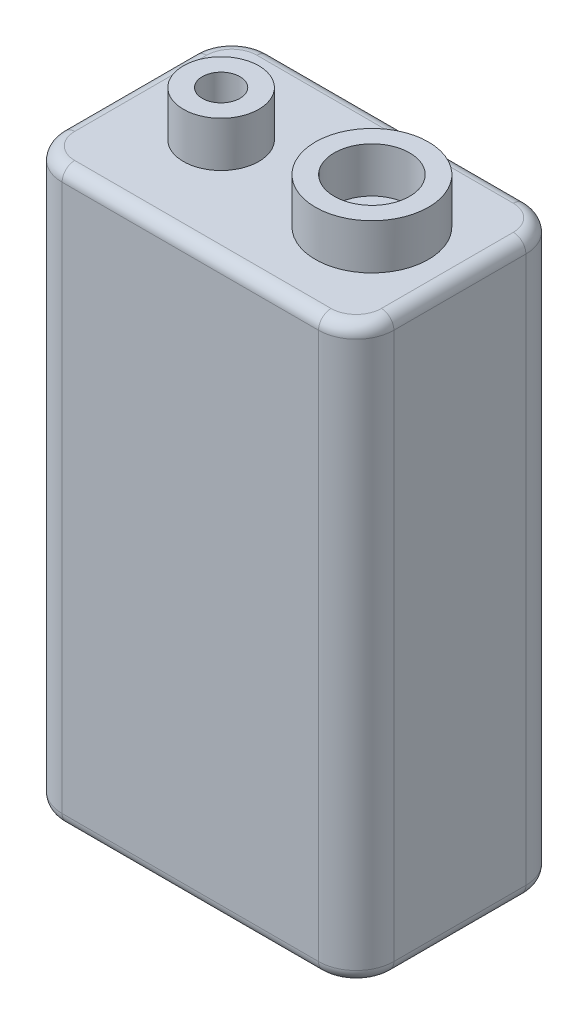
ISO-10303-21;
HEADER;
FILE_DESCRIPTION(('STEP AP214'),'2;1');
FILE_NAME('part.step','',(''),(''),'','','');
FILE_SCHEMA(('AUTOMOTIVE_DESIGN { 1 0 10303 214 1 1 1 1 }'));
ENDSEC;
DATA;
#1=APPLICATION_CONTEXT('core data for automotive mechanical design processes');
#2=APPLICATION_PROTOCOL_DEFINITION('international standard','automotive_design',2000,#1);
#3=PRODUCT_CONTEXT('',#1,'mechanical');
#4=PRODUCT('Part','Part','',(#3));
#5=PRODUCT_RELATED_PRODUCT_CATEGORY('part','',(#4));
#6=PRODUCT_DEFINITION_FORMATION('','',#4);
#7=PRODUCT_DEFINITION_CONTEXT('part definition',#1,'design');
#8=PRODUCT_DEFINITION('design','',#6,#7);
#9=PRODUCT_DEFINITION_SHAPE('','',#8);
#10=(LENGTH_UNIT() NAMED_UNIT(*) SI_UNIT(.MILLI.,.METRE.));
#11=(NAMED_UNIT(*) PLANE_ANGLE_UNIT() SI_UNIT($,.RADIAN.));
#12=(NAMED_UNIT(*) SI_UNIT($,.STERADIAN.) SOLID_ANGLE_UNIT());
#13=UNCERTAINTY_MEASURE_WITH_UNIT(LENGTH_MEASURE(1.E-05),#10,'distance_accuracy_value','');
#14=(GEOMETRIC_REPRESENTATION_CONTEXT(3) GLOBAL_UNCERTAINTY_ASSIGNED_CONTEXT((#13)) GLOBAL_UNIT_ASSIGNED_CONTEXT((#10,
#11,#12)) REPRESENTATION_CONTEXT('',''));
#15=CARTESIAN_POINT('',(0.,0.,0.));
#16=DIRECTION('',(0.,0.,1.));
#17=DIRECTION('',(1.,0.,0.));
#18=AXIS2_PLACEMENT_3D('',#15,#16,#17);
#19=CARTESIAN_POINT('',(0.,45.5,16.5));
#20=DIRECTION('',(0.,-1.,0.));
#21=DIRECTION('',(0.,0.,-1.));
#22=AXIS2_PLACEMENT_3D('',#19,#20,#21);
#23=PLANE('',#22);
#24=DIRECTION('',(-1.,0.,0.));
#25=VECTOR('',#24,1.);
#26=CARTESIAN_POINT('',(0.,45.5,15.5));
#27=LINE('',#26,#25);
#28=CARTESIAN_POINT('',(3.,45.5,15.5));
#29=VERTEX_POINT('',#28);
#30=CARTESIAN_POINT('',(23.4,45.5,15.5));
#31=VERTEX_POINT('',#30);
#32=EDGE_CURVE('E154',#29,#31,#27,.F.);
#33=ORIENTED_EDGE('',*,*,#32,.T.);
#34=CARTESIAN_POINT('',(23.4,45.5,13.5));
#35=DIRECTION('',(0.,-1.,0.));
#36=DIRECTION('',(0.,0.,-1.));
#37=AXIS2_PLACEMENT_3D('',#34,#35,#36);
#38=CIRCLE('',#37,2.);
#39=CARTESIAN_POINT('',(25.4,45.5,13.5));
#40=VERTEX_POINT('',#39);
#41=EDGE_CURVE('E191',#31,#40,#38,.F.);
#42=ORIENTED_EDGE('',*,*,#41,.T.);
#43=DIRECTION('',(0.,0.,-1.));
#44=VECTOR('',#43,1.);
#45=CARTESIAN_POINT('',(25.4,45.5,16.5));
#46=LINE('',#45,#44);
#47=CARTESIAN_POINT('',(25.4,45.5,3.));
#48=VERTEX_POINT('',#47);
#49=EDGE_CURVE('E189',#40,#48,#46,.T.);
#50=ORIENTED_EDGE('',*,*,#49,.T.);
#51=CARTESIAN_POINT('',(23.4,45.5,3.));
#52=DIRECTION('',(0.,-1.,0.));
#53=DIRECTION('',(0.,0.,-1.));
#54=AXIS2_PLACEMENT_3D('',#51,#52,#53);
#55=CIRCLE('',#54,2.);
#56=CARTESIAN_POINT('',(23.4,45.5,1.));
#57=VERTEX_POINT('',#56);
#58=EDGE_CURVE('E187',#48,#57,#55,.F.);
#59=ORIENTED_EDGE('',*,*,#58,.T.);
#60=DIRECTION('',(-1.,0.,0.));
#61=VECTOR('',#60,1.);
#62=CARTESIAN_POINT('',(3.,45.5,1.));
#63=LINE('',#62,#61);
#64=CARTESIAN_POINT('',(3.,45.5,0.999999999999999));
#65=VERTEX_POINT('',#64);
#66=EDGE_CURVE('E185',#57,#65,#63,.T.);
#67=ORIENTED_EDGE('',*,*,#66,.T.);
#68=CARTESIAN_POINT('',(3.,45.5,3.));
#69=DIRECTION('',(0.,-1.,0.));
#70=DIRECTION('',(0.,0.,-1.));
#71=AXIS2_PLACEMENT_3D('',#68,#69,#70);
#72=CIRCLE('',#71,2.);
#73=CARTESIAN_POINT('',(1.,45.5,3.));
#74=VERTEX_POINT('',#73);
#75=EDGE_CURVE('E183',#65,#74,#72,.F.);
#76=ORIENTED_EDGE('',*,*,#75,.T.);
#77=DIRECTION('',(0.,0.,-1.));
#78=VECTOR('',#77,1.);
#79=CARTESIAN_POINT('',(1.,45.5,16.5));
#80=LINE('',#79,#78);
#81=CARTESIAN_POINT('',(1.,45.5,13.5));
#82=VERTEX_POINT('',#81);
#83=EDGE_CURVE('E157',#74,#82,#80,.F.);
#84=ORIENTED_EDGE('',*,*,#83,.T.);
#85=CARTESIAN_POINT('',(3.,45.5,13.5));
#86=DIRECTION('',(0.,-1.,0.));
#87=DIRECTION('',(0.,0.,-1.));
#88=AXIS2_PLACEMENT_3D('',#85,#86,#87);
#89=CIRCLE('',#88,2.);
#90=EDGE_CURVE('E149',#82,#29,#89,.F.);
#91=ORIENTED_EDGE('',*,*,#90,.T.);
#92=EDGE_LOOP('',(#33,#42,#50,#59,#67,#76,#84,#91));
#93=FACE_BOUND('',#92,.T.);
#94=CARTESIAN_POINT('',(7.4,45.5,8.25));
#95=DIRECTION('',(0.,-1.,0.));
#96=DIRECTION('',(0.,0.,-1.));
#97=AXIS2_PLACEMENT_3D('',#94,#95,#96);
#98=CIRCLE('',#97,3.);
#99=CARTESIAN_POINT('',(7.4,45.5,5.25));
#100=VERTEX_POINT('',#99);
#101=EDGE_CURVE('E178',#100,#100,#98,.F.);
#102=ORIENTED_EDGE('',*,*,#101,.F.);
#103=EDGE_LOOP('',(#102));
#104=FACE_BOUND('',#103,.T.);
#105=CARTESIAN_POINT('',(19.4,45.5,8.25));
#106=DIRECTION('',(0.,-1.,0.));
#107=DIRECTION('',(0.,0.,-1.));
#108=AXIS2_PLACEMENT_3D('',#105,#106,#107);
#109=CIRCLE('',#108,4.5);
#110=CARTESIAN_POINT('',(19.4,45.5,3.75));
#111=VERTEX_POINT('',#110);
#112=EDGE_CURVE('E175',#111,#111,#109,.F.);
#113=ORIENTED_EDGE('',*,*,#112,.F.);
#114=EDGE_LOOP('',(#113));
#115=FACE_BOUND('',#114,.T.);
#116=ADVANCED_FACE('F36',(#93,#104,#115),#23,.F.);
#117=CARTESIAN_POINT('',(0.,0.,16.5));
#118=DIRECTION('',(1.,0.,0.));
#119=DIRECTION('',(0.,0.,-1.));
#120=AXIS2_PLACEMENT_3D('',#117,#118,#119);
#121=PLANE('',#120);
#122=DIRECTION('',(0.,-1.,0.));
#123=VECTOR('',#122,1.);
#124=CARTESIAN_POINT('',(0.,0.,13.5));
#125=LINE('',#124,#123);
#126=CARTESIAN_POINT('',(0.,1.,13.5));
#127=VERTEX_POINT('',#126);
#128=CARTESIAN_POINT('',(0.,44.5,13.5));
#129=VERTEX_POINT('',#128);
#130=EDGE_CURVE('E304',#127,#129,#125,.F.);
#131=ORIENTED_EDGE('',*,*,#130,.T.);
#132=DIRECTION('',(0.,0.,-1.));
#133=VECTOR('',#132,1.);
#134=CARTESIAN_POINT('',(0.,44.5,16.5));
#135=LINE('',#134,#133);
#136=CARTESIAN_POINT('',(0.,44.5,3.));
#137=VERTEX_POINT('',#136);
#138=EDGE_CURVE('E216',#129,#137,#135,.T.);
#139=ORIENTED_EDGE('',*,*,#138,.T.);
#140=DIRECTION('',(0.,-1.,0.));
#141=VECTOR('',#140,1.);
#142=CARTESIAN_POINT('',(0.,0.,3.));
#143=LINE('',#142,#141);
#144=CARTESIAN_POINT('',(0.,1.,3.));
#145=VERTEX_POINT('',#144);
#146=EDGE_CURVE('E299',#137,#145,#143,.T.);
#147=ORIENTED_EDGE('',*,*,#146,.T.);
#148=DIRECTION('',(0.,0.,-1.));
#149=VECTOR('',#148,1.);
#150=CARTESIAN_POINT('',(0.,1.,16.5));
#151=LINE('',#150,#149);
#152=EDGE_CURVE('E214',#145,#127,#151,.F.);
#153=ORIENTED_EDGE('',*,*,#152,.T.);
#154=EDGE_LOOP('',(#131,#139,#147,#153));
#155=FACE_BOUND('',#154,.T.);
#156=ADVANCED_FACE('F322',(#155),#121,.F.);
#157=CARTESIAN_POINT('',(0.,0.,16.5));
#158=DIRECTION('',(0.,1.,0.));
#159=DIRECTION('',(0.,0.,1.));
#160=AXIS2_PLACEMENT_3D('',#157,#158,#159);
#161=PLANE('',#160);
#162=DIRECTION('',(1.,0.,0.));
#163=VECTOR('',#162,1.);
#164=CARTESIAN_POINT('',(0.,0.,15.5));
#165=LINE('',#164,#163);
#166=CARTESIAN_POINT('',(23.4,0.,15.5));
#167=VERTEX_POINT('',#166);
#168=CARTESIAN_POINT('',(3.,0.,15.5));
#169=VERTEX_POINT('',#168);
#170=EDGE_CURVE('E53',#167,#169,#165,.F.);
#171=ORIENTED_EDGE('',*,*,#170,.T.);
#172=CARTESIAN_POINT('',(3.,0.,13.5));
#173=DIRECTION('',(0.,1.,0.));
#174=DIRECTION('',(0.,0.,1.));
#175=AXIS2_PLACEMENT_3D('',#172,#173,#174);
#176=CIRCLE('',#175,2.);
#177=CARTESIAN_POINT('',(1.,0.,13.5));
#178=VERTEX_POINT('',#177);
#179=EDGE_CURVE('E234',#169,#178,#176,.F.);
#180=ORIENTED_EDGE('',*,*,#179,.T.);
#181=DIRECTION('',(0.,0.,-1.));
#182=VECTOR('',#181,1.);
#183=CARTESIAN_POINT('',(1.,0.,16.5));
#184=LINE('',#183,#182);
#185=CARTESIAN_POINT('',(1.,0.,3.));
#186=VERTEX_POINT('',#185);
#187=EDGE_CURVE('E222',#178,#186,#184,.T.);
#188=ORIENTED_EDGE('',*,*,#187,.T.);
#189=CARTESIAN_POINT('',(3.,0.,3.));
#190=DIRECTION('',(0.,1.,0.));
#191=DIRECTION('',(0.,0.,1.));
#192=AXIS2_PLACEMENT_3D('',#189,#190,#191);
#193=CIRCLE('',#192,2.);
#194=CARTESIAN_POINT('',(3.,0.,0.999999999999999));
#195=VERTEX_POINT('',#194);
#196=EDGE_CURVE('E224',#186,#195,#193,.F.);
#197=ORIENTED_EDGE('',*,*,#196,.T.);
#198=DIRECTION('',(1.,0.,0.));
#199=VECTOR('',#198,1.);
#200=CARTESIAN_POINT('',(23.4,0.,1.));
#201=LINE('',#200,#199);
#202=CARTESIAN_POINT('',(23.4,0.,1.));
#203=VERTEX_POINT('',#202);
#204=EDGE_CURVE('E226',#195,#203,#201,.T.);
#205=ORIENTED_EDGE('',*,*,#204,.T.);
#206=CARTESIAN_POINT('',(23.4,0.,3.));
#207=DIRECTION('',(0.,1.,0.));
#208=DIRECTION('',(0.,0.,1.));
#209=AXIS2_PLACEMENT_3D('',#206,#207,#208);
#210=CIRCLE('',#209,2.);
#211=CARTESIAN_POINT('',(25.4,0.,3.));
#212=VERTEX_POINT('',#211);
#213=EDGE_CURVE('E228',#203,#212,#210,.F.);
#214=ORIENTED_EDGE('',*,*,#213,.T.);
#215=DIRECTION('',(0.,0.,-1.));
#216=VECTOR('',#215,1.);
#217=CARTESIAN_POINT('',(25.4,0.,16.5));
#218=LINE('',#217,#216);
#219=CARTESIAN_POINT('',(25.4,0.,13.5));
#220=VERTEX_POINT('',#219);
#221=EDGE_CURVE('E230',#212,#220,#218,.F.);
#222=ORIENTED_EDGE('',*,*,#221,.T.);
#223=CARTESIAN_POINT('',(23.4,0.,13.5));
#224=DIRECTION('',(0.,1.,0.));
#225=DIRECTION('',(0.,0.,1.));
#226=AXIS2_PLACEMENT_3D('',#223,#224,#225);
#227=CIRCLE('',#226,2.);
#228=EDGE_CURVE('E58',#220,#167,#227,.F.);
#229=ORIENTED_EDGE('',*,*,#228,.T.);
#230=EDGE_LOOP('',(#171,#180,#188,#197,#205,#214,#222,#229));
#231=FACE_BOUND('',#230,.T.);
#232=ADVANCED_FACE('F368',(#231),#161,.F.);
#233=CARTESIAN_POINT('',(26.4,0.,16.5));
#234=DIRECTION('',(-1.,0.,0.));
#235=DIRECTION('',(0.,0.,1.));
#236=AXIS2_PLACEMENT_3D('',#233,#234,#235);
#237=PLANE('',#236);
#238=DIRECTION('',(0.,1.,0.));
#239=VECTOR('',#238,1.);
#240=CARTESIAN_POINT('',(26.4,45.5,3.));
#241=LINE('',#240,#239);
#242=CARTESIAN_POINT('',(26.4,1.,3.));
#243=VERTEX_POINT('',#242);
#244=CARTESIAN_POINT('',(26.4,44.5,3.));
#245=VERTEX_POINT('',#244);
#246=EDGE_CURVE('E292',#243,#245,#241,.T.);
#247=ORIENTED_EDGE('',*,*,#246,.T.);
#248=DIRECTION('',(0.,0.,-1.));
#249=VECTOR('',#248,1.);
#250=CARTESIAN_POINT('',(26.4,44.5,16.5));
#251=LINE('',#250,#249);
#252=CARTESIAN_POINT('',(26.4,44.5,13.5));
#253=VERTEX_POINT('',#252);
#254=EDGE_CURVE('E200',#245,#253,#251,.F.);
#255=ORIENTED_EDGE('',*,*,#254,.T.);
#256=DIRECTION('',(0.,1.,0.));
#257=VECTOR('',#256,1.);
#258=CARTESIAN_POINT('',(26.4,0.,13.5));
#259=LINE('',#258,#257);
#260=CARTESIAN_POINT('',(26.4,1.,13.5));
#261=VERTEX_POINT('',#260);
#262=EDGE_CURVE('E313',#253,#261,#259,.F.);
#263=ORIENTED_EDGE('',*,*,#262,.T.);
#264=DIRECTION('',(0.,0.,-1.));
#265=VECTOR('',#264,1.);
#266=CARTESIAN_POINT('',(26.4,1.,16.5));
#267=LINE('',#266,#265);
#268=EDGE_CURVE('E198',#261,#243,#267,.T.);
#269=ORIENTED_EDGE('',*,*,#268,.T.);
#270=EDGE_LOOP('',(#247,#255,#263,#269));
#271=FACE_BOUND('',#270,.T.);
#272=ADVANCED_FACE('F359',(#271),#237,.F.);
#273=CARTESIAN_POINT('',(0.,0.,16.5));
#274=DIRECTION('',(0.,0.,-1.));
#275=DIRECTION('',(-1.,0.,0.));
#276=AXIS2_PLACEMENT_3D('',#273,#274,#275);
#277=PLANE('',#276);
#278=DIRECTION('',(0.,-1.,0.));
#279=VECTOR('',#278,1.);
#280=CARTESIAN_POINT('',(3.,0.,16.5));
#281=LINE('',#280,#279);
#282=CARTESIAN_POINT('',(3.,44.5,16.5));
#283=VERTEX_POINT('',#282);
#284=CARTESIAN_POINT('',(3.,1.,16.5));
#285=VERTEX_POINT('',#284);
#286=EDGE_CURVE('E310',#283,#285,#281,.T.);
#287=ORIENTED_EDGE('',*,*,#286,.T.);
#288=DIRECTION('',(1.,0.,0.));
#289=VECTOR('',#288,1.);
#290=CARTESIAN_POINT('',(0.,1.,16.5));
#291=LINE('',#290,#289);
#292=CARTESIAN_POINT('',(23.4,1.,16.5));
#293=VERTEX_POINT('',#292);
#294=EDGE_CURVE('E11',#285,#293,#291,.T.);
#295=ORIENTED_EDGE('',*,*,#294,.T.);
#296=DIRECTION('',(0.,1.,0.));
#297=VECTOR('',#296,1.);
#298=CARTESIAN_POINT('',(23.4,0.,16.5));
#299=LINE('',#298,#297);
#300=CARTESIAN_POINT('',(23.4,44.5,16.5));
#301=VERTEX_POINT('',#300);
#302=EDGE_CURVE('E301',#293,#301,#299,.T.);
#303=ORIENTED_EDGE('',*,*,#302,.T.);
#304=DIRECTION('',(-1.,0.,0.));
#305=VECTOR('',#304,1.);
#306=CARTESIAN_POINT('',(0.,44.5,16.5));
#307=LINE('',#306,#305);
#308=EDGE_CURVE('E45',#301,#283,#307,.T.);
#309=ORIENTED_EDGE('',*,*,#308,.T.);
#310=EDGE_LOOP('',(#287,#295,#303,#309));
#311=FACE_BOUND('',#310,.T.);
#312=ADVANCED_FACE('F356',(#311),#277,.F.);
#313=CARTESIAN_POINT('',(0.,0.,0.));
#314=DIRECTION('',(0.,0.,-1.));
#315=DIRECTION('',(-1.,0.,0.));
#316=AXIS2_PLACEMENT_3D('',#313,#314,#315);
#317=PLANE('',#316);
#318=DIRECTION('',(0.,-1.,0.));
#319=VECTOR('',#318,1.);
#320=CARTESIAN_POINT('',(3.,45.5,0.));
#321=LINE('',#320,#319);
#322=CARTESIAN_POINT('',(3.,1.,0.));
#323=VERTEX_POINT('',#322);
#324=CARTESIAN_POINT('',(3.,44.5,0.));
#325=VERTEX_POINT('',#324);
#326=EDGE_CURVE('E298',#323,#325,#321,.F.);
#327=ORIENTED_EDGE('',*,*,#326,.T.);
#328=DIRECTION('',(-1.,0.,0.));
#329=VECTOR('',#328,1.);
#330=CARTESIAN_POINT('',(23.4,44.5,0.));
#331=LINE('',#330,#329);
#332=CARTESIAN_POINT('',(23.4,44.5,0.));
#333=VERTEX_POINT('',#332);
#334=EDGE_CURVE('E208',#325,#333,#331,.F.);
#335=ORIENTED_EDGE('',*,*,#334,.T.);
#336=DIRECTION('',(0.,1.,0.));
#337=VECTOR('',#336,1.);
#338=CARTESIAN_POINT('',(23.4,0.,0.));
#339=LINE('',#338,#337);
#340=CARTESIAN_POINT('',(23.4,1.,0.));
#341=VERTEX_POINT('',#340);
#342=EDGE_CURVE('E289',#333,#341,#339,.F.);
#343=ORIENTED_EDGE('',*,*,#342,.T.);
#344=DIRECTION('',(1.,0.,0.));
#345=VECTOR('',#344,1.);
#346=CARTESIAN_POINT('',(3.,1.,0.));
#347=LINE('',#346,#345);
#348=EDGE_CURVE('E206',#341,#323,#347,.F.);
#349=ORIENTED_EDGE('',*,*,#348,.T.);
#350=EDGE_LOOP('',(#327,#335,#343,#349));
#351=FACE_BOUND('',#350,.T.);
#352=ADVANCED_FACE('F295',(#351),#317,.T.);
#353=CARTESIAN_POINT('',(3.,0.,3.));
#354=DIRECTION('',(0.,1.,0.));
#355=DIRECTION('',(0.,0.,1.));
#356=AXIS2_PLACEMENT_3D('',#353,#354,#355);
#357=CYLINDRICAL_SURFACE('',#356,3.);
#358=ORIENTED_EDGE('',*,*,#146,.F.);
#359=CARTESIAN_POINT('',(3.,44.5,3.));
#360=DIRECTION('',(0.,-1.,0.));
#361=DIRECTION('',(0.,0.,-1.));
#362=AXIS2_PLACEMENT_3D('',#359,#360,#361);
#363=CIRCLE('',#362,3.);
#364=EDGE_CURVE('E212',#137,#325,#363,.T.);
#365=ORIENTED_EDGE('',*,*,#364,.T.);
#366=ORIENTED_EDGE('',*,*,#326,.F.);
#367=CARTESIAN_POINT('',(3.,1.,3.));
#368=DIRECTION('',(0.,1.,0.));
#369=DIRECTION('',(0.,0.,1.));
#370=AXIS2_PLACEMENT_3D('',#367,#368,#369);
#371=CIRCLE('',#370,3.);
#372=EDGE_CURVE('E210',#323,#145,#371,.T.);
#373=ORIENTED_EDGE('',*,*,#372,.T.);
#374=EDGE_LOOP('',(#358,#365,#366,#373));
#375=FACE_BOUND('',#374,.T.);
#376=ADVANCED_FACE('F362',(#375),#357,.T.);
#377=CARTESIAN_POINT('',(3.,0.,13.5));
#378=DIRECTION('',(0.,-1.,0.));
#379=DIRECTION('',(0.,0.,-1.));
#380=AXIS2_PLACEMENT_3D('',#377,#378,#379);
#381=CYLINDRICAL_SURFACE('',#380,3.);
#382=ORIENTED_EDGE('',*,*,#286,.F.);
#383=CARTESIAN_POINT('',(3.,44.5,13.5));
#384=DIRECTION('',(0.,-1.,0.));
#385=DIRECTION('',(0.,0.,-1.));
#386=AXIS2_PLACEMENT_3D('',#383,#384,#385);
#387=CIRCLE('',#386,3.);
#388=EDGE_CURVE('E166',#283,#129,#387,.T.);
#389=ORIENTED_EDGE('',*,*,#388,.T.);
#390=ORIENTED_EDGE('',*,*,#130,.F.);
#391=CARTESIAN_POINT('',(3.,1.,13.5));
#392=DIRECTION('',(0.,1.,0.));
#393=DIRECTION('',(0.,0.,1.));
#394=AXIS2_PLACEMENT_3D('',#391,#392,#393);
#395=CIRCLE('',#394,3.);
#396=EDGE_CURVE('E218',#127,#285,#395,.T.);
#397=ORIENTED_EDGE('',*,*,#396,.T.);
#398=EDGE_LOOP('',(#382,#389,#390,#397));
#399=FACE_BOUND('',#398,.T.);
#400=ADVANCED_FACE('F377',(#399),#381,.T.);
#401=CARTESIAN_POINT('',(23.4,0.,3.));
#402=DIRECTION('',(0.,-1.,0.));
#403=DIRECTION('',(0.,0.,-1.));
#404=AXIS2_PLACEMENT_3D('',#401,#402,#403);
#405=CYLINDRICAL_SURFACE('',#404,3.);
#406=ORIENTED_EDGE('',*,*,#342,.F.);
#407=CARTESIAN_POINT('',(23.4,44.5,3.));
#408=DIRECTION('',(0.,-1.,0.));
#409=DIRECTION('',(0.,0.,-1.));
#410=AXIS2_PLACEMENT_3D('',#407,#408,#409);
#411=CIRCLE('',#410,3.);
#412=EDGE_CURVE('E204',#333,#245,#411,.T.);
#413=ORIENTED_EDGE('',*,*,#412,.T.);
#414=ORIENTED_EDGE('',*,*,#246,.F.);
#415=CARTESIAN_POINT('',(23.4,1.,3.));
#416=DIRECTION('',(0.,1.,0.));
#417=DIRECTION('',(0.,0.,1.));
#418=AXIS2_PLACEMENT_3D('',#415,#416,#417);
#419=CIRCLE('',#418,3.);
#420=EDGE_CURVE('E202',#243,#341,#419,.T.);
#421=ORIENTED_EDGE('',*,*,#420,.T.);
#422=EDGE_LOOP('',(#406,#413,#414,#421));
#423=FACE_BOUND('',#422,.T.);
#424=ADVANCED_FACE('F288',(#423),#405,.T.);
#425=CARTESIAN_POINT('',(23.4,0.,13.5));
#426=DIRECTION('',(0.,1.,0.));
#427=DIRECTION('',(0.,0.,1.));
#428=AXIS2_PLACEMENT_3D('',#425,#426,#427);
#429=CYLINDRICAL_SURFACE('',#428,3.);
#430=ORIENTED_EDGE('',*,*,#262,.F.);
#431=CARTESIAN_POINT('',(23.4,44.5,13.5));
#432=DIRECTION('',(0.,-1.,0.));
#433=DIRECTION('',(0.,0.,-1.));
#434=AXIS2_PLACEMENT_3D('',#431,#432,#433);
#435=CIRCLE('',#434,3.);
#436=EDGE_CURVE('E195',#253,#301,#435,.T.);
#437=ORIENTED_EDGE('',*,*,#436,.T.);
#438=ORIENTED_EDGE('',*,*,#302,.F.);
#439=CARTESIAN_POINT('',(23.4,1.,13.5));
#440=DIRECTION('',(0.,1.,0.));
#441=DIRECTION('',(0.,0.,1.));
#442=AXIS2_PLACEMENT_3D('',#439,#440,#441);
#443=CIRCLE('',#442,3.);
#444=EDGE_CURVE('E193',#293,#261,#443,.T.);
#445=ORIENTED_EDGE('',*,*,#444,.T.);
#446=EDGE_LOOP('',(#430,#437,#438,#445));
#447=FACE_BOUND('',#446,.T.);
#448=ADVANCED_FACE('F351',(#447),#429,.T.);
#449=CARTESIAN_POINT('',(7.4,49.1,8.25));
#450=DIRECTION('',(0.,1.,0.));
#451=DIRECTION('',(0.,0.,1.));
#452=AXIS2_PLACEMENT_3D('',#449,#450,#451);
#453=PLANE('',#452);
#454=CARTESIAN_POINT('',(7.4,49.1,8.25));
#455=DIRECTION('',(0.,1.,0.));
#456=DIRECTION('',(0.,0.,1.));
#457=AXIS2_PLACEMENT_3D('',#454,#455,#456);
#458=CIRCLE('',#457,3.);
#459=CARTESIAN_POINT('',(7.4,49.1,11.25));
#460=VERTEX_POINT('',#459);
#461=EDGE_CURVE('E674',#460,#460,#458,.T.);
#462=ORIENTED_EDGE('',*,*,#461,.T.);
#463=EDGE_LOOP('',(#462));
#464=FACE_BOUND('',#463,.T.);
#465=CARTESIAN_POINT('',(7.4,49.1,8.25));
#466=DIRECTION('',(0.,1.,0.));
#467=DIRECTION('',(0.,0.,1.));
#468=AXIS2_PLACEMENT_3D('',#465,#466,#467);
#469=CIRCLE('',#468,1.5);
#470=CARTESIAN_POINT('',(7.4,49.1,9.75));
#471=VERTEX_POINT('',#470);
#472=EDGE_CURVE('E671',#471,#471,#469,.T.);
#473=ORIENTED_EDGE('',*,*,#472,.F.);
#474=EDGE_LOOP('',(#473));
#475=FACE_BOUND('',#474,.T.);
#476=ADVANCED_FACE('F348',(#464,#475),#453,.T.);
#477=CARTESIAN_POINT('',(7.4,49.1,8.25));
#478=DIRECTION('',(0.,-1.,0.));
#479=DIRECTION('',(0.,0.,-1.));
#480=AXIS2_PLACEMENT_3D('',#477,#478,#479);
#481=CYLINDRICAL_SURFACE('',#480,3.);
#482=ORIENTED_EDGE('',*,*,#461,.F.);
#483=EDGE_LOOP('',(#482));
#484=FACE_BOUND('',#483,.T.);
#485=ORIENTED_EDGE('',*,*,#101,.T.);
#486=EDGE_LOOP('',(#485));
#487=FACE_BOUND('',#486,.T.);
#488=ADVANCED_FACE('F319',(#484,#487),#481,.T.);
#489=CARTESIAN_POINT('',(7.4,49.1,8.25));
#490=DIRECTION('',(0.,-1.,0.));
#491=DIRECTION('',(0.,0.,-1.));
#492=AXIS2_PLACEMENT_3D('',#489,#490,#491);
#493=CYLINDRICAL_SURFACE('',#492,1.5);
#494=ORIENTED_EDGE('',*,*,#472,.T.);
#495=EDGE_LOOP('',(#494));
#496=FACE_BOUND('',#495,.T.);
#497=CARTESIAN_POINT('',(7.4,45.5,8.25));
#498=DIRECTION('',(0.,1.,0.));
#499=DIRECTION('',(0.,0.,1.));
#500=AXIS2_PLACEMENT_3D('',#497,#498,#499);
#501=CIRCLE('',#500,1.5);
#502=CARTESIAN_POINT('',(7.4,45.5,9.75));
#503=VERTEX_POINT('',#502);
#504=EDGE_CURVE('E670',#503,#503,#501,.T.);
#505=ORIENTED_EDGE('',*,*,#504,.F.);
#506=EDGE_LOOP('',(#505));
#507=FACE_BOUND('',#506,.T.);
#508=ADVANCED_FACE('F344',(#496,#507),#493,.F.);
#509=ORIENTED_EDGE('',*,*,#504,.T.);
#510=EDGE_LOOP('',(#509));
#511=FACE_BOUND('',#510,.T.);
#512=ADVANCED_FACE('F325',(#511),#23,.F.);
#513=CARTESIAN_POINT('',(19.4,49.1,8.25));
#514=DIRECTION('',(0.,1.,0.));
#515=DIRECTION('',(0.,0.,1.));
#516=AXIS2_PLACEMENT_3D('',#513,#514,#515);
#517=PLANE('',#516);
#518=CARTESIAN_POINT('',(19.4,49.1,8.25));
#519=DIRECTION('',(0.,1.,0.));
#520=DIRECTION('',(0.,0.,1.));
#521=AXIS2_PLACEMENT_3D('',#518,#519,#520);
#522=CIRCLE('',#521,4.5);
#523=CARTESIAN_POINT('',(19.4,49.1,12.75));
#524=VERTEX_POINT('',#523);
#525=EDGE_CURVE('E665',#524,#524,#522,.T.);
#526=ORIENTED_EDGE('',*,*,#525,.T.);
#527=EDGE_LOOP('',(#526));
#528=FACE_BOUND('',#527,.T.);
#529=CARTESIAN_POINT('',(19.4,49.1,8.25));
#530=DIRECTION('',(0.,1.,0.));
#531=DIRECTION('',(0.,0.,1.));
#532=AXIS2_PLACEMENT_3D('',#529,#530,#531);
#533=CIRCLE('',#532,3.);
#534=CARTESIAN_POINT('',(19.4,49.1,11.25));
#535=VERTEX_POINT('',#534);
#536=EDGE_CURVE('E662',#535,#535,#533,.T.);
#537=ORIENTED_EDGE('',*,*,#536,.F.);
#538=EDGE_LOOP('',(#537));
#539=FACE_BOUND('',#538,.T.);
#540=ADVANCED_FACE('F331',(#528,#539),#517,.T.);
#541=CARTESIAN_POINT('',(19.4,49.1,8.25));
#542=DIRECTION('',(0.,-1.,0.));
#543=DIRECTION('',(0.,0.,-1.));
#544=AXIS2_PLACEMENT_3D('',#541,#542,#543);
#545=CYLINDRICAL_SURFACE('',#544,4.5);
#546=ORIENTED_EDGE('',*,*,#525,.F.);
#547=EDGE_LOOP('',(#546));
#548=FACE_BOUND('',#547,.T.);
#549=ORIENTED_EDGE('',*,*,#112,.T.);
#550=EDGE_LOOP('',(#549));
#551=FACE_BOUND('',#550,.T.);
#552=ADVANCED_FACE('F328',(#548,#551),#545,.T.);
#553=CARTESIAN_POINT('',(19.4,49.1,8.25));
#554=DIRECTION('',(0.,-1.,0.));
#555=DIRECTION('',(0.,0.,-1.));
#556=AXIS2_PLACEMENT_3D('',#553,#554,#555);
#557=CYLINDRICAL_SURFACE('',#556,3.);
#558=ORIENTED_EDGE('',*,*,#536,.T.);
#559=EDGE_LOOP('',(#558));
#560=FACE_BOUND('',#559,.T.);
#561=CARTESIAN_POINT('',(19.4,45.5,8.25));
#562=DIRECTION('',(0.,1.,0.));
#563=DIRECTION('',(0.,0.,1.));
#564=AXIS2_PLACEMENT_3D('',#561,#562,#563);
#565=CIRCLE('',#564,3.);
#566=CARTESIAN_POINT('',(19.4,45.5,11.25));
#567=VERTEX_POINT('',#566);
#568=EDGE_CURVE('E252',#567,#567,#565,.T.);
#569=ORIENTED_EDGE('',*,*,#568,.F.);
#570=EDGE_LOOP('',(#569));
#571=FACE_BOUND('',#570,.T.);
#572=ADVANCED_FACE('F330',(#560,#571),#557,.F.);
#573=ORIENTED_EDGE('',*,*,#568,.T.);
#574=EDGE_LOOP('',(#573));
#575=FACE_BOUND('',#574,.T.);
#576=ADVANCED_FACE('F324',(#575),#23,.F.);
#577=CARTESIAN_POINT('',(3.,44.5,3.));
#578=DIRECTION('',(0.,-1.,0.));
#579=DIRECTION('',(0.,0.,-1.));
#580=AXIS2_PLACEMENT_3D('',#577,#578,#579);
#581=TOROIDAL_SURFACE('',#580,2.,1.);
#582=CARTESIAN_POINT('',(3.,44.5,0.999999999999999));
#583=DIRECTION('',(1.,0.,0.));
#584=DIRECTION('',(0.,0.,-1.));
#585=AXIS2_PLACEMENT_3D('',#582,#583,#584);
#586=CIRCLE('',#585,1.);
#587=EDGE_CURVE('E246',#325,#65,#586,.T.);
#588=ORIENTED_EDGE('',*,*,#587,.F.);
#589=ORIENTED_EDGE('',*,*,#364,.F.);
#590=CARTESIAN_POINT('',(1.,44.5,3.));
#591=DIRECTION('',(0.,0.,1.));
#592=DIRECTION('',(1.,0.,0.));
#593=AXIS2_PLACEMENT_3D('',#590,#591,#592);
#594=CIRCLE('',#593,1.);
#595=EDGE_CURVE('E249',#74,#137,#594,.T.);
#596=ORIENTED_EDGE('',*,*,#595,.F.);
#597=ORIENTED_EDGE('',*,*,#75,.F.);
#598=EDGE_LOOP('',(#588,#589,#596,#597));
#599=FACE_BOUND('',#598,.T.);
#600=ADVANCED_FACE('F410',(#599),#581,.T.);
#601=CARTESIAN_POINT('',(1.,44.5,16.5));
#602=DIRECTION('',(0.,0.,-1.));
#603=DIRECTION('',(-1.,0.,0.));
#604=AXIS2_PLACEMENT_3D('',#601,#602,#603);
#605=CYLINDRICAL_SURFACE('',#604,1.);
#606=ORIENTED_EDGE('',*,*,#595,.T.);
#607=ORIENTED_EDGE('',*,*,#138,.F.);
#608=CARTESIAN_POINT('',(1.,44.5,13.5));
#609=DIRECTION('',(0.,0.,1.));
#610=DIRECTION('',(1.,0.,0.));
#611=AXIS2_PLACEMENT_3D('',#608,#609,#610);
#612=CIRCLE('',#611,1.);
#613=EDGE_CURVE('E244',#82,#129,#612,.T.);
#614=ORIENTED_EDGE('',*,*,#613,.F.);
#615=ORIENTED_EDGE('',*,*,#83,.F.);
#616=EDGE_LOOP('',(#606,#607,#614,#615));
#617=FACE_BOUND('',#616,.T.);
#618=ADVANCED_FACE('F406',(#617),#605,.T.);
#619=CARTESIAN_POINT('',(0.,44.5,1.));
#620=DIRECTION('',(1.,0.,0.));
#621=DIRECTION('',(0.,0.,-1.));
#622=AXIS2_PLACEMENT_3D('',#619,#620,#621);
#623=CYLINDRICAL_SURFACE('',#622,1.);
#624=ORIENTED_EDGE('',*,*,#587,.T.);
#625=ORIENTED_EDGE('',*,*,#66,.F.);
#626=CARTESIAN_POINT('',(23.4,44.5,1.));
#627=DIRECTION('',(1.,0.,0.));
#628=DIRECTION('',(0.,0.,-1.));
#629=AXIS2_PLACEMENT_3D('',#626,#627,#628);
#630=CIRCLE('',#629,1.);
#631=EDGE_CURVE('E169',#333,#57,#630,.T.);
#632=ORIENTED_EDGE('',*,*,#631,.F.);
#633=ORIENTED_EDGE('',*,*,#334,.F.);
#634=EDGE_LOOP('',(#624,#625,#632,#633));
#635=FACE_BOUND('',#634,.T.);
#636=ADVANCED_FACE('F403',(#635),#623,.T.);
#637=CARTESIAN_POINT('',(3.,44.5,13.5));
#638=DIRECTION('',(0.,-1.,0.));
#639=DIRECTION('',(0.,0.,-1.));
#640=AXIS2_PLACEMENT_3D('',#637,#638,#639);
#641=TOROIDAL_SURFACE('',#640,2.,1.);
#642=ORIENTED_EDGE('',*,*,#613,.T.);
#643=ORIENTED_EDGE('',*,*,#388,.F.);
#644=CARTESIAN_POINT('',(3.,44.5,15.5));
#645=DIRECTION('',(1.,0.,0.));
#646=DIRECTION('',(0.,0.,-1.));
#647=AXIS2_PLACEMENT_3D('',#644,#645,#646);
#648=CIRCLE('',#647,1.);
#649=EDGE_CURVE('E164',#29,#283,#648,.T.);
#650=ORIENTED_EDGE('',*,*,#649,.F.);
#651=ORIENTED_EDGE('',*,*,#90,.F.);
#652=EDGE_LOOP('',(#642,#643,#650,#651));
#653=FACE_BOUND('',#652,.T.);
#654=ADVANCED_FACE('F165',(#653),#641,.T.);
#655=CARTESIAN_POINT('',(23.4,44.5,3.));
#656=DIRECTION('',(0.,-1.,0.));
#657=DIRECTION('',(0.,0.,-1.));
#658=AXIS2_PLACEMENT_3D('',#655,#656,#657);
#659=TOROIDAL_SURFACE('',#658,2.,1.);
#660=ORIENTED_EDGE('',*,*,#631,.T.);
#661=ORIENTED_EDGE('',*,*,#58,.F.);
#662=CARTESIAN_POINT('',(25.4,44.5,3.));
#663=DIRECTION('',(0.,0.,1.));
#664=DIRECTION('',(1.,0.,0.));
#665=AXIS2_PLACEMENT_3D('',#662,#663,#664);
#666=CIRCLE('',#665,1.);
#667=EDGE_CURVE('E170',#245,#48,#666,.T.);
#668=ORIENTED_EDGE('',*,*,#667,.F.);
#669=ORIENTED_EDGE('',*,*,#412,.F.);
#670=EDGE_LOOP('',(#660,#661,#668,#669));
#671=FACE_BOUND('',#670,.T.);
#672=ADVANCED_FACE('F397',(#671),#659,.T.);
#673=CARTESIAN_POINT('',(0.,44.5,15.5));
#674=DIRECTION('',(-1.,0.,0.));
#675=DIRECTION('',(0.,0.,1.));
#676=AXIS2_PLACEMENT_3D('',#673,#674,#675);
#677=CYLINDRICAL_SURFACE('',#676,1.);
#678=ORIENTED_EDGE('',*,*,#649,.T.);
#679=ORIENTED_EDGE('',*,*,#308,.F.);
#680=CARTESIAN_POINT('',(23.4,44.5,15.5));
#681=DIRECTION('',(1.,0.,0.));
#682=DIRECTION('',(0.,0.,-1.));
#683=AXIS2_PLACEMENT_3D('',#680,#681,#682);
#684=CIRCLE('',#683,1.);
#685=EDGE_CURVE('E173',#31,#301,#684,.T.);
#686=ORIENTED_EDGE('',*,*,#685,.F.);
#687=ORIENTED_EDGE('',*,*,#32,.F.);
#688=EDGE_LOOP('',(#678,#679,#686,#687));
#689=FACE_BOUND('',#688,.T.);
#690=ADVANCED_FACE('F172',(#689),#677,.T.);
#691=CARTESIAN_POINT('',(25.4,44.5,16.5));
#692=DIRECTION('',(0.,0.,-1.));
#693=DIRECTION('',(-1.,0.,0.));
#694=AXIS2_PLACEMENT_3D('',#691,#692,#693);
#695=CYLINDRICAL_SURFACE('',#694,1.);
#696=ORIENTED_EDGE('',*,*,#667,.T.);
#697=ORIENTED_EDGE('',*,*,#49,.F.);
#698=CARTESIAN_POINT('',(25.4,44.5,13.5));
#699=DIRECTION('',(0.,0.,1.));
#700=DIRECTION('',(1.,0.,0.));
#701=AXIS2_PLACEMENT_3D('',#698,#699,#700);
#702=CIRCLE('',#701,1.);
#703=EDGE_CURVE('E237',#253,#40,#702,.T.);
#704=ORIENTED_EDGE('',*,*,#703,.F.);
#705=ORIENTED_EDGE('',*,*,#254,.F.);
#706=EDGE_LOOP('',(#696,#697,#704,#705));
#707=FACE_BOUND('',#706,.T.);
#708=ADVANCED_FACE('F390',(#707),#695,.T.);
#709=CARTESIAN_POINT('',(23.4,44.5,13.5));
#710=DIRECTION('',(0.,-1.,0.));
#711=DIRECTION('',(0.,0.,-1.));
#712=AXIS2_PLACEMENT_3D('',#709,#710,#711);
#713=TOROIDAL_SURFACE('',#712,2.,1.);
#714=ORIENTED_EDGE('',*,*,#685,.T.);
#715=ORIENTED_EDGE('',*,*,#436,.F.);
#716=ORIENTED_EDGE('',*,*,#703,.T.);
#717=ORIENTED_EDGE('',*,*,#41,.F.);
#718=EDGE_LOOP('',(#714,#715,#716,#717));
#719=FACE_BOUND('',#718,.T.);
#720=ADVANCED_FACE('F387',(#719),#713,.T.);
#721=CARTESIAN_POINT('',(23.4,1.,3.));
#722=DIRECTION('',(0.,1.,0.));
#723=DIRECTION('',(0.,0.,1.));
#724=AXIS2_PLACEMENT_3D('',#721,#722,#723);
#725=TOROIDAL_SURFACE('',#724,2.,1.);
#726=CARTESIAN_POINT('',(23.4,1.,0.999999999999999));
#727=DIRECTION('',(-1.,0.,0.));
#728=DIRECTION('',(0.,0.,1.));
#729=AXIS2_PLACEMENT_3D('',#726,#727,#728);
#730=CIRCLE('',#729,1.);
#731=EDGE_CURVE('E268',#341,#203,#730,.T.);
#732=ORIENTED_EDGE('',*,*,#731,.F.);
#733=ORIENTED_EDGE('',*,*,#420,.F.);
#734=CARTESIAN_POINT('',(25.4,1.,3.));
#735=DIRECTION('',(0.,0.,1.));
#736=DIRECTION('',(1.,0.,0.));
#737=AXIS2_PLACEMENT_3D('',#734,#735,#736);
#738=CIRCLE('',#737,1.);
#739=EDGE_CURVE('E40',#212,#243,#738,.T.);
#740=ORIENTED_EDGE('',*,*,#739,.F.);
#741=ORIENTED_EDGE('',*,*,#213,.F.);
#742=EDGE_LOOP('',(#732,#733,#740,#741));
#743=FACE_BOUND('',#742,.T.);
#744=ADVANCED_FACE('F38',(#743),#725,.T.);
#745=CARTESIAN_POINT('',(25.4,1.,16.5));
#746=DIRECTION('',(0.,0.,-1.));
#747=DIRECTION('',(-1.,0.,0.));
#748=AXIS2_PLACEMENT_3D('',#745,#746,#747);
#749=CYLINDRICAL_SURFACE('',#748,1.);
#750=ORIENTED_EDGE('',*,*,#739,.T.);
#751=ORIENTED_EDGE('',*,*,#268,.F.);
#752=CARTESIAN_POINT('',(25.4,1.,13.5));
#753=DIRECTION('',(0.,0.,1.));
#754=DIRECTION('',(1.,0.,0.));
#755=AXIS2_PLACEMENT_3D('',#752,#753,#754);
#756=CIRCLE('',#755,1.);
#757=EDGE_CURVE('E266',#220,#261,#756,.T.);
#758=ORIENTED_EDGE('',*,*,#757,.F.);
#759=ORIENTED_EDGE('',*,*,#221,.F.);
#760=EDGE_LOOP('',(#750,#751,#758,#759));
#761=FACE_BOUND('',#760,.T.);
#762=ADVANCED_FACE('F279',(#761),#749,.T.);
#763=CARTESIAN_POINT('',(0.,1.,1.));
#764=DIRECTION('',(-1.,0.,0.));
#765=DIRECTION('',(0.,0.,1.));
#766=AXIS2_PLACEMENT_3D('',#763,#764,#765);
#767=CYLINDRICAL_SURFACE('',#766,1.);
#768=ORIENTED_EDGE('',*,*,#731,.T.);
#769=ORIENTED_EDGE('',*,*,#204,.F.);
#770=CARTESIAN_POINT('',(3.,1.,1.));
#771=DIRECTION('',(-1.,0.,0.));
#772=DIRECTION('',(0.,0.,1.));
#773=AXIS2_PLACEMENT_3D('',#770,#771,#772);
#774=CIRCLE('',#773,1.);
#775=EDGE_CURVE('E263',#323,#195,#774,.T.);
#776=ORIENTED_EDGE('',*,*,#775,.F.);
#777=ORIENTED_EDGE('',*,*,#348,.F.);
#778=EDGE_LOOP('',(#768,#769,#776,#777));
#779=FACE_BOUND('',#778,.T.);
#780=ADVANCED_FACE('F434',(#779),#767,.T.);
#781=CARTESIAN_POINT('',(23.4,1.,13.5));
#782=DIRECTION('',(0.,1.,0.));
#783=DIRECTION('',(0.,0.,1.));
#784=AXIS2_PLACEMENT_3D('',#781,#782,#783);
#785=TOROIDAL_SURFACE('',#784,2.,1.);
#786=ORIENTED_EDGE('',*,*,#757,.T.);
#787=ORIENTED_EDGE('',*,*,#444,.F.);
#788=CARTESIAN_POINT('',(23.4,1.,15.5));
#789=DIRECTION('',(-1.,0.,0.));
#790=DIRECTION('',(0.,0.,1.));
#791=AXIS2_PLACEMENT_3D('',#788,#789,#790);
#792=CIRCLE('',#791,1.);
#793=EDGE_CURVE('E260',#167,#293,#792,.T.);
#794=ORIENTED_EDGE('',*,*,#793,.F.);
#795=ORIENTED_EDGE('',*,*,#228,.F.);
#796=EDGE_LOOP('',(#786,#787,#794,#795));
#797=FACE_BOUND('',#796,.T.);
#798=ADVANCED_FACE('F430',(#797),#785,.T.);
#799=CARTESIAN_POINT('',(3.,1.,3.));
#800=DIRECTION('',(0.,1.,0.));
#801=DIRECTION('',(0.,0.,1.));
#802=AXIS2_PLACEMENT_3D('',#799,#800,#801);
#803=TOROIDAL_SURFACE('',#802,2.,1.);
#804=ORIENTED_EDGE('',*,*,#775,.T.);
#805=ORIENTED_EDGE('',*,*,#196,.F.);
#806=CARTESIAN_POINT('',(1.,1.,3.));
#807=DIRECTION('',(0.,0.,1.));
#808=DIRECTION('',(1.,0.,0.));
#809=AXIS2_PLACEMENT_3D('',#806,#807,#808);
#810=CIRCLE('',#809,1.);
#811=EDGE_CURVE('E257',#145,#186,#810,.T.);
#812=ORIENTED_EDGE('',*,*,#811,.F.);
#813=ORIENTED_EDGE('',*,*,#372,.F.);
#814=EDGE_LOOP('',(#804,#805,#812,#813));
#815=FACE_BOUND('',#814,.T.);
#816=ADVANCED_FACE('F426',(#815),#803,.T.);
#817=CARTESIAN_POINT('',(0.,1.,15.5));
#818=DIRECTION('',(1.,0.,0.));
#819=DIRECTION('',(0.,0.,-1.));
#820=AXIS2_PLACEMENT_3D('',#817,#818,#819);
#821=CYLINDRICAL_SURFACE('',#820,1.);
#822=ORIENTED_EDGE('',*,*,#793,.T.);
#823=ORIENTED_EDGE('',*,*,#294,.F.);
#824=CARTESIAN_POINT('',(3.,1.,15.5));
#825=DIRECTION('',(-1.,0.,0.));
#826=DIRECTION('',(0.,0.,1.));
#827=AXIS2_PLACEMENT_3D('',#824,#825,#826);
#828=CIRCLE('',#827,1.);
#829=EDGE_CURVE('E255',#169,#285,#828,.T.);
#830=ORIENTED_EDGE('',*,*,#829,.F.);
#831=ORIENTED_EDGE('',*,*,#170,.F.);
#832=EDGE_LOOP('',(#822,#823,#830,#831));
#833=FACE_BOUND('',#832,.T.);
#834=ADVANCED_FACE('F422',(#833),#821,.T.);
#835=CARTESIAN_POINT('',(1.,1.,16.5));
#836=DIRECTION('',(0.,0.,-1.));
#837=DIRECTION('',(-1.,0.,0.));
#838=AXIS2_PLACEMENT_3D('',#835,#836,#837);
#839=CYLINDRICAL_SURFACE('',#838,1.);
#840=ORIENTED_EDGE('',*,*,#811,.T.);
#841=ORIENTED_EDGE('',*,*,#187,.F.);
#842=CARTESIAN_POINT('',(1.,1.,13.5));
#843=DIRECTION('',(0.,0.,1.));
#844=DIRECTION('',(1.,0.,0.));
#845=AXIS2_PLACEMENT_3D('',#842,#843,#844);
#846=CIRCLE('',#845,1.);
#847=EDGE_CURVE('E253',#127,#178,#846,.T.);
#848=ORIENTED_EDGE('',*,*,#847,.F.);
#849=ORIENTED_EDGE('',*,*,#152,.F.);
#850=EDGE_LOOP('',(#840,#841,#848,#849));
#851=FACE_BOUND('',#850,.T.);
#852=ADVANCED_FACE('F418',(#851),#839,.T.);
#853=CARTESIAN_POINT('',(3.,1.,13.5));
#854=DIRECTION('',(0.,1.,0.));
#855=DIRECTION('',(0.,0.,1.));
#856=AXIS2_PLACEMENT_3D('',#853,#854,#855);
#857=TOROIDAL_SURFACE('',#856,2.,1.);
#858=ORIENTED_EDGE('',*,*,#829,.T.);
#859=ORIENTED_EDGE('',*,*,#396,.F.);
#860=ORIENTED_EDGE('',*,*,#847,.T.);
#861=ORIENTED_EDGE('',*,*,#179,.F.);
#862=EDGE_LOOP('',(#858,#859,#860,#861));
#863=FACE_BOUND('',#862,.T.);
#864=ADVANCED_FACE('F415',(#863),#857,.T.);
#865=CLOSED_SHELL('',(#116,#156,#232,#272,#312,#352,#376,#400,#424,#448,#476,#488,#508,#512,
#540,#552,#572,#576,#600,#618,#636,#654,#672,#690,#708,#720,#744,#762,#780,#798,#816,#834,#852,#864));
#866=MANIFOLD_SOLID_BREP('B2',#865);
#867=ADVANCED_BREP_SHAPE_REPRESENTATION('',(#18,#866),#14);
#868=SHAPE_DEFINITION_REPRESENTATION(#9,#867);
ENDSEC;
END-ISO-10303-21;
